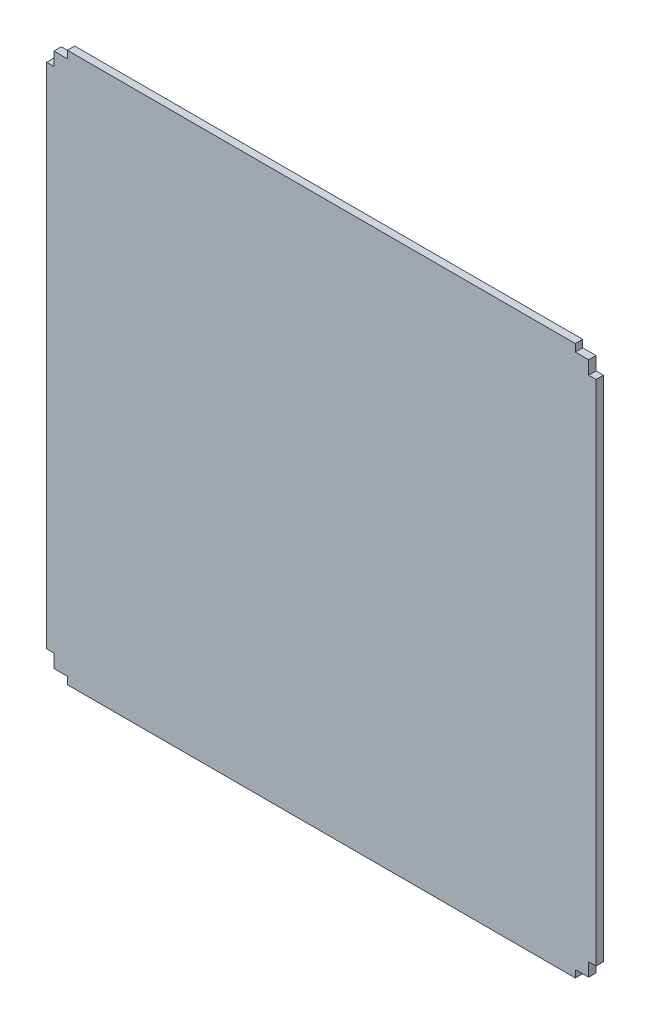
ISO-10303-21;
HEADER;
FILE_DESCRIPTION(('STEP AP214'),'2;1');
FILE_NAME('part.step','',(''),(''),'','','');
FILE_SCHEMA(('AUTOMOTIVE_DESIGN { 1 0 10303 214 1 1 1 1 }'));
ENDSEC;
DATA;
#1=APPLICATION_CONTEXT('core data for automotive mechanical design processes');
#2=APPLICATION_PROTOCOL_DEFINITION('international standard','automotive_design',2000,#1);
#3=PRODUCT_CONTEXT('',#1,'mechanical');
#4=PRODUCT('Part','Part','',(#3));
#5=PRODUCT_RELATED_PRODUCT_CATEGORY('part','',(#4));
#6=PRODUCT_DEFINITION_FORMATION('','',#4);
#7=PRODUCT_DEFINITION_CONTEXT('part definition',#1,'design');
#8=PRODUCT_DEFINITION('design','',#6,#7);
#9=PRODUCT_DEFINITION_SHAPE('','',#8);
#10=(LENGTH_UNIT() NAMED_UNIT(*) SI_UNIT(.MILLI.,.METRE.));
#11=(NAMED_UNIT(*) PLANE_ANGLE_UNIT() SI_UNIT($,.RADIAN.));
#12=(NAMED_UNIT(*) SI_UNIT($,.STERADIAN.) SOLID_ANGLE_UNIT());
#13=UNCERTAINTY_MEASURE_WITH_UNIT(LENGTH_MEASURE(1.E-05),#10,'distance_accuracy_value','');
#14=(GEOMETRIC_REPRESENTATION_CONTEXT(3) GLOBAL_UNCERTAINTY_ASSIGNED_CONTEXT((#13)) GLOBAL_UNIT_ASSIGNED_CONTEXT((#10,
#11,#12)) REPRESENTATION_CONTEXT('',''));
#15=CARTESIAN_POINT('',(0.,0.,0.));
#16=DIRECTION('',(0.,0.,1.));
#17=DIRECTION('',(1.,0.,0.));
#18=AXIS2_PLACEMENT_3D('',#15,#16,#17);
#19=CARTESIAN_POINT('',(0.,0.,2.75));
#20=DIRECTION('',(1.,0.,0.));
#21=DIRECTION('',(0.,0.,-1.));
#22=AXIS2_PLACEMENT_3D('',#19,#20,#21);
#23=PLANE('',#22);
#24=DIRECTION('',(0.,-1.,0.));
#25=VECTOR('',#24,1.);
#26=CARTESIAN_POINT('',(0.,0.,0.));
#27=LINE('',#26,#25);
#28=CARTESIAN_POINT('',(0.,5.,0.));
#29=VERTEX_POINT('',#28);
#30=CARTESIAN_POINT('',(0.,0.,0.));
#31=VERTEX_POINT('',#30);
#32=EDGE_CURVE('E212',#29,#31,#27,.T.);
#33=ORIENTED_EDGE('',*,*,#32,.T.);
#34=DIRECTION('',(0.,0.,-1.));
#35=VECTOR('',#34,1.);
#36=CARTESIAN_POINT('',(0.,0.,2.75));
#37=LINE('',#36,#35);
#38=CARTESIAN_POINT('',(0.,0.,2.75));
#39=VERTEX_POINT('',#38);
#40=EDGE_CURVE('E11',#39,#31,#37,.T.);
#41=ORIENTED_EDGE('',*,*,#40,.F.);
#42=DIRECTION('',(0.,-1.,0.));
#43=VECTOR('',#42,1.);
#44=CARTESIAN_POINT('',(0.,0.,2.75));
#45=LINE('',#44,#43);
#46=CARTESIAN_POINT('',(0.,5.,2.75));
#47=VERTEX_POINT('',#46);
#48=EDGE_CURVE('E270',#47,#39,#45,.T.);
#49=ORIENTED_EDGE('',*,*,#48,.F.);
#50=DIRECTION('',(0.,0.,-1.));
#51=VECTOR('',#50,1.);
#52=CARTESIAN_POINT('',(0.,5.,2.75));
#53=LINE('',#52,#51);
#54=EDGE_CURVE('E208',#47,#29,#53,.T.);
#55=ORIENTED_EDGE('',*,*,#54,.T.);
#56=EDGE_LOOP('',(#33,#41,#49,#55));
#57=FACE_BOUND('',#56,.T.);
#58=ADVANCED_FACE('F39',(#57),#23,.F.);
#59=CARTESIAN_POINT('',(0.,0.,2.75));
#60=DIRECTION('',(0.,1.,0.));
#61=DIRECTION('',(0.,0.,1.));
#62=AXIS2_PLACEMENT_3D('',#59,#60,#61);
#63=PLANE('',#62);
#64=DIRECTION('',(1.,0.,0.));
#65=VECTOR('',#64,1.);
#66=CARTESIAN_POINT('',(0.,0.,0.));
#67=LINE('',#66,#65);
#68=CARTESIAN_POINT('',(5.,0.,0.));
#69=VERTEX_POINT('',#68);
#70=EDGE_CURVE('E216',#31,#69,#67,.T.);
#71=ORIENTED_EDGE('',*,*,#70,.T.);
#72=DIRECTION('',(0.,0.,-1.));
#73=VECTOR('',#72,1.);
#74=CARTESIAN_POINT('',(5.,0.,2.75));
#75=LINE('',#74,#73);
#76=CARTESIAN_POINT('',(5.,0.,2.75));
#77=VERTEX_POINT('',#76);
#78=EDGE_CURVE('E48',#77,#69,#75,.T.);
#79=ORIENTED_EDGE('',*,*,#78,.F.);
#80=DIRECTION('',(1.,0.,0.));
#81=VECTOR('',#80,1.);
#82=CARTESIAN_POINT('',(0.,0.,2.75));
#83=LINE('',#82,#81);
#84=EDGE_CURVE('E135',#39,#77,#83,.T.);
#85=ORIENTED_EDGE('',*,*,#84,.F.);
#86=ORIENTED_EDGE('',*,*,#40,.T.);
#87=EDGE_LOOP('',(#71,#79,#85,#86));
#88=FACE_BOUND('',#87,.T.);
#89=ADVANCED_FACE('F420',(#88),#63,.F.);
#90=CARTESIAN_POINT('',(5.,0.,2.75));
#91=DIRECTION('',(1.,0.,0.));
#92=DIRECTION('',(0.,0.,-1.));
#93=AXIS2_PLACEMENT_3D('',#90,#91,#92);
#94=PLANE('',#93);
#95=DIRECTION('',(0.,-1.,0.));
#96=VECTOR('',#95,1.);
#97=CARTESIAN_POINT('',(5.,0.,0.));
#98=LINE('',#97,#96);
#99=CARTESIAN_POINT('',(5.,-2.75,0.));
#100=VERTEX_POINT('',#99);
#101=EDGE_CURVE('E219',#69,#100,#98,.T.);
#102=ORIENTED_EDGE('',*,*,#101,.T.);
#103=DIRECTION('',(0.,0.,-1.));
#104=VECTOR('',#103,1.);
#105=CARTESIAN_POINT('',(5.,-2.75,2.75));
#106=LINE('',#105,#104);
#107=CARTESIAN_POINT('',(5.,-2.75,2.75));
#108=VERTEX_POINT('',#107);
#109=EDGE_CURVE('E329',#108,#100,#106,.T.);
#110=ORIENTED_EDGE('',*,*,#109,.F.);
#111=DIRECTION('',(0.,-1.,0.));
#112=VECTOR('',#111,1.);
#113=CARTESIAN_POINT('',(5.,0.,2.75));
#114=LINE('',#113,#112);
#115=EDGE_CURVE('E339',#77,#108,#114,.T.);
#116=ORIENTED_EDGE('',*,*,#115,.F.);
#117=ORIENTED_EDGE('',*,*,#78,.T.);
#118=EDGE_LOOP('',(#102,#110,#116,#117));
#119=FACE_BOUND('',#118,.T.);
#120=ADVANCED_FACE('F337',(#119),#94,.F.);
#121=CARTESIAN_POINT('',(195.,-2.75,2.75));
#122=DIRECTION('',(0.,1.,0.));
#123=DIRECTION('',(0.,0.,1.));
#124=AXIS2_PLACEMENT_3D('',#121,#122,#123);
#125=PLANE('',#124);
#126=DIRECTION('',(1.,0.,0.));
#127=VECTOR('',#126,1.);
#128=CARTESIAN_POINT('',(195.,-2.75,0.));
#129=LINE('',#128,#127);
#130=CARTESIAN_POINT('',(195.,-2.75,0.));
#131=VERTEX_POINT('',#130);
#132=EDGE_CURVE('E222',#100,#131,#129,.T.);
#133=ORIENTED_EDGE('',*,*,#132,.T.);
#134=DIRECTION('',(0.,0.,-1.));
#135=VECTOR('',#134,1.);
#136=CARTESIAN_POINT('',(195.,-2.75,2.75));
#137=LINE('',#136,#135);
#138=CARTESIAN_POINT('',(195.,-2.75,2.75));
#139=VERTEX_POINT('',#138);
#140=EDGE_CURVE('E325',#139,#131,#137,.T.);
#141=ORIENTED_EDGE('',*,*,#140,.F.);
#142=DIRECTION('',(1.,0.,0.));
#143=VECTOR('',#142,1.);
#144=CARTESIAN_POINT('',(195.,-2.75,2.75));
#145=LINE('',#144,#143);
#146=EDGE_CURVE('E358',#108,#139,#145,.T.);
#147=ORIENTED_EDGE('',*,*,#146,.F.);
#148=ORIENTED_EDGE('',*,*,#109,.T.);
#149=EDGE_LOOP('',(#133,#141,#147,#148));
#150=FACE_BOUND('',#149,.T.);
#151=ADVANCED_FACE('F348',(#150),#125,.F.);
#152=CARTESIAN_POINT('',(195.,0.,2.75));
#153=DIRECTION('',(-1.,0.,0.));
#154=DIRECTION('',(0.,0.,1.));
#155=AXIS2_PLACEMENT_3D('',#152,#153,#154);
#156=PLANE('',#155);
#157=DIRECTION('',(0.,1.,0.));
#158=VECTOR('',#157,1.);
#159=CARTESIAN_POINT('',(195.,0.,0.));
#160=LINE('',#159,#158);
#161=CARTESIAN_POINT('',(195.,0.,0.));
#162=VERTEX_POINT('',#161);
#163=EDGE_CURVE('E225',#131,#162,#160,.T.);
#164=ORIENTED_EDGE('',*,*,#163,.T.);
#165=DIRECTION('',(0.,0.,-1.));
#166=VECTOR('',#165,1.);
#167=CARTESIAN_POINT('',(195.,0.,2.75));
#168=LINE('',#167,#166);
#169=CARTESIAN_POINT('',(195.,0.,2.75));
#170=VERTEX_POINT('',#169);
#171=EDGE_CURVE('E321',#170,#162,#168,.T.);
#172=ORIENTED_EDGE('',*,*,#171,.F.);
#173=DIRECTION('',(0.,1.,0.));
#174=VECTOR('',#173,1.);
#175=CARTESIAN_POINT('',(195.,0.,2.75));
#176=LINE('',#175,#174);
#177=EDGE_CURVE('E354',#139,#170,#176,.T.);
#178=ORIENTED_EDGE('',*,*,#177,.F.);
#179=ORIENTED_EDGE('',*,*,#140,.T.);
#180=EDGE_LOOP('',(#164,#172,#178,#179));
#181=FACE_BOUND('',#180,.T.);
#182=ADVANCED_FACE('F352',(#181),#156,.F.);
#183=CARTESIAN_POINT('',(200.,0.,2.75));
#184=DIRECTION('',(0.,1.,0.));
#185=DIRECTION('',(0.,0.,1.));
#186=AXIS2_PLACEMENT_3D('',#183,#184,#185);
#187=PLANE('',#186);
#188=DIRECTION('',(1.,0.,0.));
#189=VECTOR('',#188,1.);
#190=CARTESIAN_POINT('',(200.,0.,0.));
#191=LINE('',#190,#189);
#192=CARTESIAN_POINT('',(200.,0.,0.));
#193=VERTEX_POINT('',#192);
#194=EDGE_CURVE('E228',#162,#193,#191,.T.);
#195=ORIENTED_EDGE('',*,*,#194,.T.);
#196=DIRECTION('',(0.,0.,-1.));
#197=VECTOR('',#196,1.);
#198=CARTESIAN_POINT('',(200.,0.,2.75));
#199=LINE('',#198,#197);
#200=CARTESIAN_POINT('',(200.,0.,2.75));
#201=VERTEX_POINT('',#200);
#202=EDGE_CURVE('E317',#201,#193,#199,.T.);
#203=ORIENTED_EDGE('',*,*,#202,.F.);
#204=DIRECTION('',(1.,0.,0.));
#205=VECTOR('',#204,1.);
#206=CARTESIAN_POINT('',(200.,0.,2.75));
#207=LINE('',#206,#205);
#208=EDGE_CURVE('E357',#170,#201,#207,.T.);
#209=ORIENTED_EDGE('',*,*,#208,.F.);
#210=ORIENTED_EDGE('',*,*,#171,.T.);
#211=EDGE_LOOP('',(#195,#203,#209,#210));
#212=FACE_BOUND('',#211,.T.);
#213=ADVANCED_FACE('F433',(#212),#187,.F.);
#214=CARTESIAN_POINT('',(200.,0.,2.75));
#215=DIRECTION('',(-1.,0.,0.));
#216=DIRECTION('',(0.,0.,1.));
#217=AXIS2_PLACEMENT_3D('',#214,#215,#216);
#218=PLANE('',#217);
#219=DIRECTION('',(0.,1.,0.));
#220=VECTOR('',#219,1.);
#221=CARTESIAN_POINT('',(200.,0.,0.));
#222=LINE('',#221,#220);
#223=CARTESIAN_POINT('',(200.,5.,0.));
#224=VERTEX_POINT('',#223);
#225=EDGE_CURVE('E231',#193,#224,#222,.T.);
#226=ORIENTED_EDGE('',*,*,#225,.T.);
#227=DIRECTION('',(0.,0.,-1.));
#228=VECTOR('',#227,1.);
#229=CARTESIAN_POINT('',(200.,5.,2.75));
#230=LINE('',#229,#228);
#231=CARTESIAN_POINT('',(200.,5.,2.75));
#232=VERTEX_POINT('',#231);
#233=EDGE_CURVE('E313',#232,#224,#230,.T.);
#234=ORIENTED_EDGE('',*,*,#233,.F.);
#235=DIRECTION('',(0.,1.,0.));
#236=VECTOR('',#235,1.);
#237=CARTESIAN_POINT('',(200.,0.,2.75));
#238=LINE('',#237,#236);
#239=EDGE_CURVE('E362',#201,#232,#238,.T.);
#240=ORIENTED_EDGE('',*,*,#239,.F.);
#241=ORIENTED_EDGE('',*,*,#202,.T.);
#242=EDGE_LOOP('',(#226,#234,#240,#241));
#243=FACE_BOUND('',#242,.T.);
#244=ADVANCED_FACE('F436',(#243),#218,.F.);
#245=CARTESIAN_POINT('',(200.,5.,2.75));
#246=DIRECTION('',(0.,1.,0.));
#247=DIRECTION('',(0.,0.,1.));
#248=AXIS2_PLACEMENT_3D('',#245,#246,#247);
#249=PLANE('',#248);
#250=DIRECTION('',(1.,0.,0.));
#251=VECTOR('',#250,1.);
#252=CARTESIAN_POINT('',(200.,5.,0.));
#253=LINE('',#252,#251);
#254=CARTESIAN_POINT('',(202.75,5.,0.));
#255=VERTEX_POINT('',#254);
#256=EDGE_CURVE('E234',#224,#255,#253,.T.);
#257=ORIENTED_EDGE('',*,*,#256,.T.);
#258=DIRECTION('',(0.,0.,-1.));
#259=VECTOR('',#258,1.);
#260=CARTESIAN_POINT('',(202.75,5.,2.75));
#261=LINE('',#260,#259);
#262=CARTESIAN_POINT('',(202.75,5.,2.75));
#263=VERTEX_POINT('',#262);
#264=EDGE_CURVE('E309',#263,#255,#261,.T.);
#265=ORIENTED_EDGE('',*,*,#264,.F.);
#266=DIRECTION('',(1.,0.,0.));
#267=VECTOR('',#266,1.);
#268=CARTESIAN_POINT('',(200.,5.,2.75));
#269=LINE('',#268,#267);
#270=EDGE_CURVE('E369',#232,#263,#269,.T.);
#271=ORIENTED_EDGE('',*,*,#270,.F.);
#272=ORIENTED_EDGE('',*,*,#233,.T.);
#273=EDGE_LOOP('',(#257,#265,#271,#272));
#274=FACE_BOUND('',#273,.T.);
#275=ADVANCED_FACE('F440',(#274),#249,.F.);
#276=CARTESIAN_POINT('',(202.75,5.,2.75));
#277=DIRECTION('',(-1.,0.,0.));
#278=DIRECTION('',(0.,0.,1.));
#279=AXIS2_PLACEMENT_3D('',#276,#277,#278);
#280=PLANE('',#279);
#281=DIRECTION('',(0.,1.,0.));
#282=VECTOR('',#281,1.);
#283=CARTESIAN_POINT('',(202.75,5.,0.));
#284=LINE('',#283,#282);
#285=CARTESIAN_POINT('',(202.75,195.,0.));
#286=VERTEX_POINT('',#285);
#287=EDGE_CURVE('E237',#255,#286,#284,.T.);
#288=ORIENTED_EDGE('',*,*,#287,.T.);
#289=DIRECTION('',(0.,0.,-1.));
#290=VECTOR('',#289,1.);
#291=CARTESIAN_POINT('',(202.75,195.,2.75));
#292=LINE('',#291,#290);
#293=CARTESIAN_POINT('',(202.75,195.,2.75));
#294=VERTEX_POINT('',#293);
#295=EDGE_CURVE('E305',#294,#286,#292,.T.);
#296=ORIENTED_EDGE('',*,*,#295,.F.);
#297=DIRECTION('',(0.,1.,0.));
#298=VECTOR('',#297,1.);
#299=CARTESIAN_POINT('',(202.75,5.,2.75));
#300=LINE('',#299,#298);
#301=EDGE_CURVE('E372',#263,#294,#300,.T.);
#302=ORIENTED_EDGE('',*,*,#301,.F.);
#303=ORIENTED_EDGE('',*,*,#264,.T.);
#304=EDGE_LOOP('',(#288,#296,#302,#303));
#305=FACE_BOUND('',#304,.T.);
#306=ADVANCED_FACE('F444',(#305),#280,.F.);
#307=CARTESIAN_POINT('',(202.75,195.,2.75));
#308=DIRECTION('',(0.,-1.,0.));
#309=DIRECTION('',(0.,0.,-1.));
#310=AXIS2_PLACEMENT_3D('',#307,#308,#309);
#311=PLANE('',#310);
#312=DIRECTION('',(-1.,0.,0.));
#313=VECTOR('',#312,1.);
#314=CARTESIAN_POINT('',(202.75,195.,0.));
#315=LINE('',#314,#313);
#316=CARTESIAN_POINT('',(200.,195.,0.));
#317=VERTEX_POINT('',#316);
#318=EDGE_CURVE('E240',#286,#317,#315,.T.);
#319=ORIENTED_EDGE('',*,*,#318,.T.);
#320=DIRECTION('',(0.,0.,-1.));
#321=VECTOR('',#320,1.);
#322=CARTESIAN_POINT('',(200.,195.,2.75));
#323=LINE('',#322,#321);
#324=CARTESIAN_POINT('',(200.,195.,2.75));
#325=VERTEX_POINT('',#324);
#326=EDGE_CURVE('E301',#325,#317,#323,.T.);
#327=ORIENTED_EDGE('',*,*,#326,.F.);
#328=DIRECTION('',(-1.,0.,0.));
#329=VECTOR('',#328,1.);
#330=CARTESIAN_POINT('',(202.75,195.,2.75));
#331=LINE('',#330,#329);
#332=EDGE_CURVE('E375',#294,#325,#331,.T.);
#333=ORIENTED_EDGE('',*,*,#332,.F.);
#334=ORIENTED_EDGE('',*,*,#295,.T.);
#335=EDGE_LOOP('',(#319,#327,#333,#334));
#336=FACE_BOUND('',#335,.T.);
#337=ADVANCED_FACE('F448',(#336),#311,.F.);
#338=CARTESIAN_POINT('',(200.,195.,2.75));
#339=DIRECTION('',(-1.,0.,0.));
#340=DIRECTION('',(0.,0.,1.));
#341=AXIS2_PLACEMENT_3D('',#338,#339,#340);
#342=PLANE('',#341);
#343=DIRECTION('',(0.,1.,0.));
#344=VECTOR('',#343,1.);
#345=CARTESIAN_POINT('',(200.,195.,0.));
#346=LINE('',#345,#344);
#347=CARTESIAN_POINT('',(200.,200.,0.));
#348=VERTEX_POINT('',#347);
#349=EDGE_CURVE('E243',#317,#348,#346,.T.);
#350=ORIENTED_EDGE('',*,*,#349,.T.);
#351=DIRECTION('',(0.,0.,-1.));
#352=VECTOR('',#351,1.);
#353=CARTESIAN_POINT('',(200.,200.,2.75));
#354=LINE('',#353,#352);
#355=CARTESIAN_POINT('',(200.,200.,2.75));
#356=VERTEX_POINT('',#355);
#357=EDGE_CURVE('E297',#356,#348,#354,.T.);
#358=ORIENTED_EDGE('',*,*,#357,.F.);
#359=DIRECTION('',(0.,1.,0.));
#360=VECTOR('',#359,1.);
#361=CARTESIAN_POINT('',(200.,195.,2.75));
#362=LINE('',#361,#360);
#363=EDGE_CURVE('E378',#325,#356,#362,.T.);
#364=ORIENTED_EDGE('',*,*,#363,.F.);
#365=ORIENTED_EDGE('',*,*,#326,.T.);
#366=EDGE_LOOP('',(#350,#358,#364,#365));
#367=FACE_BOUND('',#366,.T.);
#368=ADVANCED_FACE('F452',(#367),#342,.F.);
#369=CARTESIAN_POINT('',(200.,200.,2.75));
#370=DIRECTION('',(0.,-1.,0.));
#371=DIRECTION('',(0.,0.,-1.));
#372=AXIS2_PLACEMENT_3D('',#369,#370,#371);
#373=PLANE('',#372);
#374=DIRECTION('',(-1.,0.,0.));
#375=VECTOR('',#374,1.);
#376=CARTESIAN_POINT('',(200.,200.,0.));
#377=LINE('',#376,#375);
#378=CARTESIAN_POINT('',(195.,200.,0.));
#379=VERTEX_POINT('',#378);
#380=EDGE_CURVE('E246',#348,#379,#377,.T.);
#381=ORIENTED_EDGE('',*,*,#380,.T.);
#382=DIRECTION('',(0.,0.,-1.));
#383=VECTOR('',#382,1.);
#384=CARTESIAN_POINT('',(195.,200.,2.75));
#385=LINE('',#384,#383);
#386=CARTESIAN_POINT('',(195.,200.,2.75));
#387=VERTEX_POINT('',#386);
#388=EDGE_CURVE('E293',#387,#379,#385,.T.);
#389=ORIENTED_EDGE('',*,*,#388,.F.);
#390=DIRECTION('',(-1.,0.,0.));
#391=VECTOR('',#390,1.);
#392=CARTESIAN_POINT('',(200.,200.,2.75));
#393=LINE('',#392,#391);
#394=EDGE_CURVE('E381',#356,#387,#393,.T.);
#395=ORIENTED_EDGE('',*,*,#394,.F.);
#396=ORIENTED_EDGE('',*,*,#357,.T.);
#397=EDGE_LOOP('',(#381,#389,#395,#396));
#398=FACE_BOUND('',#397,.T.);
#399=ADVANCED_FACE('F456',(#398),#373,.F.);
#400=CARTESIAN_POINT('',(195.,200.,2.75));
#401=DIRECTION('',(-1.,0.,0.));
#402=DIRECTION('',(0.,0.,1.));
#403=AXIS2_PLACEMENT_3D('',#400,#401,#402);
#404=PLANE('',#403);
#405=DIRECTION('',(0.,1.,0.));
#406=VECTOR('',#405,1.);
#407=CARTESIAN_POINT('',(195.,200.,0.));
#408=LINE('',#407,#406);
#409=CARTESIAN_POINT('',(195.,202.75,0.));
#410=VERTEX_POINT('',#409);
#411=EDGE_CURVE('E249',#379,#410,#408,.T.);
#412=ORIENTED_EDGE('',*,*,#411,.T.);
#413=DIRECTION('',(0.,0.,-1.));
#414=VECTOR('',#413,1.);
#415=CARTESIAN_POINT('',(195.,202.75,2.75));
#416=LINE('',#415,#414);
#417=CARTESIAN_POINT('',(195.,202.75,2.75));
#418=VERTEX_POINT('',#417);
#419=EDGE_CURVE('E289',#418,#410,#416,.T.);
#420=ORIENTED_EDGE('',*,*,#419,.F.);
#421=DIRECTION('',(0.,1.,0.));
#422=VECTOR('',#421,1.);
#423=CARTESIAN_POINT('',(195.,200.,2.75));
#424=LINE('',#423,#422);
#425=EDGE_CURVE('E384',#387,#418,#424,.T.);
#426=ORIENTED_EDGE('',*,*,#425,.F.);
#427=ORIENTED_EDGE('',*,*,#388,.T.);
#428=EDGE_LOOP('',(#412,#420,#426,#427));
#429=FACE_BOUND('',#428,.T.);
#430=ADVANCED_FACE('F460',(#429),#404,.F.);
#431=CARTESIAN_POINT('',(195.,202.75,2.75));
#432=DIRECTION('',(0.,-1.,0.));
#433=DIRECTION('',(0.,0.,-1.));
#434=AXIS2_PLACEMENT_3D('',#431,#432,#433);
#435=PLANE('',#434);
#436=DIRECTION('',(-1.,0.,0.));
#437=VECTOR('',#436,1.);
#438=CARTESIAN_POINT('',(195.,202.75,0.));
#439=LINE('',#438,#437);
#440=CARTESIAN_POINT('',(5.,202.75,0.));
#441=VERTEX_POINT('',#440);
#442=EDGE_CURVE('E252',#410,#441,#439,.T.);
#443=ORIENTED_EDGE('',*,*,#442,.T.);
#444=DIRECTION('',(0.,0.,-1.));
#445=VECTOR('',#444,1.);
#446=CARTESIAN_POINT('',(5.,202.75,2.75));
#447=LINE('',#446,#445);
#448=CARTESIAN_POINT('',(5.,202.75,2.75));
#449=VERTEX_POINT('',#448);
#450=EDGE_CURVE('E285',#449,#441,#447,.T.);
#451=ORIENTED_EDGE('',*,*,#450,.F.);
#452=DIRECTION('',(-1.,0.,0.));
#453=VECTOR('',#452,1.);
#454=CARTESIAN_POINT('',(195.,202.75,2.75));
#455=LINE('',#454,#453);
#456=EDGE_CURVE('E387',#418,#449,#455,.T.);
#457=ORIENTED_EDGE('',*,*,#456,.F.);
#458=ORIENTED_EDGE('',*,*,#419,.T.);
#459=EDGE_LOOP('',(#443,#451,#457,#458));
#460=FACE_BOUND('',#459,.T.);
#461=ADVANCED_FACE('F464',(#460),#435,.F.);
#462=CARTESIAN_POINT('',(5.,202.75,2.75));
#463=DIRECTION('',(1.,0.,0.));
#464=DIRECTION('',(0.,0.,-1.));
#465=AXIS2_PLACEMENT_3D('',#462,#463,#464);
#466=PLANE('',#465);
#467=DIRECTION('',(0.,-1.,0.));
#468=VECTOR('',#467,1.);
#469=CARTESIAN_POINT('',(5.,202.75,0.));
#470=LINE('',#469,#468);
#471=CARTESIAN_POINT('',(5.,200.,0.));
#472=VERTEX_POINT('',#471);
#473=EDGE_CURVE('E255',#441,#472,#470,.T.);
#474=ORIENTED_EDGE('',*,*,#473,.T.);
#475=DIRECTION('',(0.,0.,-1.));
#476=VECTOR('',#475,1.);
#477=CARTESIAN_POINT('',(5.,200.,2.75));
#478=LINE('',#477,#476);
#479=CARTESIAN_POINT('',(5.,200.,2.75));
#480=VERTEX_POINT('',#479);
#481=EDGE_CURVE('E281',#480,#472,#478,.T.);
#482=ORIENTED_EDGE('',*,*,#481,.F.);
#483=DIRECTION('',(0.,-1.,0.));
#484=VECTOR('',#483,1.);
#485=CARTESIAN_POINT('',(5.,202.75,2.75));
#486=LINE('',#485,#484);
#487=EDGE_CURVE('E390',#449,#480,#486,.T.);
#488=ORIENTED_EDGE('',*,*,#487,.F.);
#489=ORIENTED_EDGE('',*,*,#450,.T.);
#490=EDGE_LOOP('',(#474,#482,#488,#489));
#491=FACE_BOUND('',#490,.T.);
#492=ADVANCED_FACE('F468',(#491),#466,.F.);
#493=CARTESIAN_POINT('',(0.,200.,2.75));
#494=DIRECTION('',(0.,-1.,0.));
#495=DIRECTION('',(0.,0.,-1.));
#496=AXIS2_PLACEMENT_3D('',#493,#494,#495);
#497=PLANE('',#496);
#498=DIRECTION('',(-1.,0.,0.));
#499=VECTOR('',#498,1.);
#500=CARTESIAN_POINT('',(0.,200.,0.));
#501=LINE('',#500,#499);
#502=CARTESIAN_POINT('',(0.,200.,0.));
#503=VERTEX_POINT('',#502);
#504=EDGE_CURVE('E258',#472,#503,#501,.T.);
#505=ORIENTED_EDGE('',*,*,#504,.T.);
#506=DIRECTION('',(0.,0.,-1.));
#507=VECTOR('',#506,1.);
#508=CARTESIAN_POINT('',(0.,200.,2.75));
#509=LINE('',#508,#507);
#510=CARTESIAN_POINT('',(0.,200.,2.75));
#511=VERTEX_POINT('',#510);
#512=EDGE_CURVE('E277',#511,#503,#509,.T.);
#513=ORIENTED_EDGE('',*,*,#512,.F.);
#514=DIRECTION('',(-1.,0.,0.));
#515=VECTOR('',#514,1.);
#516=CARTESIAN_POINT('',(0.,200.,2.75));
#517=LINE('',#516,#515);
#518=EDGE_CURVE('E393',#480,#511,#517,.T.);
#519=ORIENTED_EDGE('',*,*,#518,.F.);
#520=ORIENTED_EDGE('',*,*,#481,.T.);
#521=EDGE_LOOP('',(#505,#513,#519,#520));
#522=FACE_BOUND('',#521,.T.);
#523=ADVANCED_FACE('F401',(#522),#497,.F.);
#524=CARTESIAN_POINT('',(0.,200.,2.75));
#525=DIRECTION('',(1.,0.,0.));
#526=DIRECTION('',(0.,0.,-1.));
#527=AXIS2_PLACEMENT_3D('',#524,#525,#526);
#528=PLANE('',#527);
#529=DIRECTION('',(0.,-1.,0.));
#530=VECTOR('',#529,1.);
#531=CARTESIAN_POINT('',(0.,200.,0.));
#532=LINE('',#531,#530);
#533=CARTESIAN_POINT('',(0.,195.,0.));
#534=VERTEX_POINT('',#533);
#535=EDGE_CURVE('E261',#503,#534,#532,.T.);
#536=ORIENTED_EDGE('',*,*,#535,.T.);
#537=DIRECTION('',(0.,0.,-1.));
#538=VECTOR('',#537,1.);
#539=CARTESIAN_POINT('',(0.,195.,2.75));
#540=LINE('',#539,#538);
#541=CARTESIAN_POINT('',(0.,195.,2.75));
#542=VERTEX_POINT('',#541);
#543=EDGE_CURVE('E201',#542,#534,#540,.T.);
#544=ORIENTED_EDGE('',*,*,#543,.F.);
#545=DIRECTION('',(0.,-1.,0.));
#546=VECTOR('',#545,1.);
#547=CARTESIAN_POINT('',(0.,200.,2.75));
#548=LINE('',#547,#546);
#549=EDGE_CURVE('E190',#511,#542,#548,.T.);
#550=ORIENTED_EDGE('',*,*,#549,.F.);
#551=ORIENTED_EDGE('',*,*,#512,.T.);
#552=EDGE_LOOP('',(#536,#544,#550,#551));
#553=FACE_BOUND('',#552,.T.);
#554=ADVANCED_FACE('F405',(#553),#528,.F.);
#555=CARTESIAN_POINT('',(0.,195.,2.75));
#556=DIRECTION('',(0.,-1.,0.));
#557=DIRECTION('',(0.,0.,-1.));
#558=AXIS2_PLACEMENT_3D('',#555,#556,#557);
#559=PLANE('',#558);
#560=DIRECTION('',(-1.,0.,0.));
#561=VECTOR('',#560,1.);
#562=CARTESIAN_POINT('',(0.,195.,0.));
#563=LINE('',#562,#561);
#564=CARTESIAN_POINT('',(-2.75,195.,0.));
#565=VERTEX_POINT('',#564);
#566=EDGE_CURVE('E199',#534,#565,#563,.T.);
#567=ORIENTED_EDGE('',*,*,#566,.T.);
#568=DIRECTION('',(0.,0.,-1.));
#569=VECTOR('',#568,1.);
#570=CARTESIAN_POINT('',(-2.75,195.,2.75));
#571=LINE('',#570,#569);
#572=CARTESIAN_POINT('',(-2.75,195.,2.75));
#573=VERTEX_POINT('',#572);
#574=EDGE_CURVE('E196',#573,#565,#571,.T.);
#575=ORIENTED_EDGE('',*,*,#574,.F.);
#576=DIRECTION('',(-1.,0.,0.));
#577=VECTOR('',#576,1.);
#578=CARTESIAN_POINT('',(0.,195.,2.75));
#579=LINE('',#578,#577);
#580=EDGE_CURVE('E184',#542,#573,#579,.T.);
#581=ORIENTED_EDGE('',*,*,#580,.F.);
#582=ORIENTED_EDGE('',*,*,#543,.T.);
#583=EDGE_LOOP('',(#567,#575,#581,#582));
#584=FACE_BOUND('',#583,.T.);
#585=ADVANCED_FACE('F197',(#584),#559,.F.);
#586=CARTESIAN_POINT('',(-2.75,195.,2.75));
#587=DIRECTION('',(1.,0.,0.));
#588=DIRECTION('',(0.,0.,-1.));
#589=AXIS2_PLACEMENT_3D('',#586,#587,#588);
#590=PLANE('',#589);
#591=DIRECTION('',(0.,-1.,0.));
#592=VECTOR('',#591,1.);
#593=CARTESIAN_POINT('',(-2.75,195.,0.));
#594=LINE('',#593,#592);
#595=CARTESIAN_POINT('',(-2.75,5.,0.));
#596=VERTEX_POINT('',#595);
#597=EDGE_CURVE('E121',#565,#596,#594,.T.);
#598=ORIENTED_EDGE('',*,*,#597,.T.);
#599=DIRECTION('',(0.,0.,-1.));
#600=VECTOR('',#599,1.);
#601=CARTESIAN_POINT('',(-2.75,5.,2.75));
#602=LINE('',#601,#600);
#603=CARTESIAN_POINT('',(-2.75,5.,2.75));
#604=VERTEX_POINT('',#603);
#605=EDGE_CURVE('E202',#604,#596,#602,.T.);
#606=ORIENTED_EDGE('',*,*,#605,.F.);
#607=DIRECTION('',(0.,-1.,0.));
#608=VECTOR('',#607,1.);
#609=CARTESIAN_POINT('',(-2.75,195.,2.75));
#610=LINE('',#609,#608);
#611=EDGE_CURVE('E188',#573,#604,#610,.T.);
#612=ORIENTED_EDGE('',*,*,#611,.F.);
#613=ORIENTED_EDGE('',*,*,#574,.T.);
#614=EDGE_LOOP('',(#598,#606,#612,#613));
#615=FACE_BOUND('',#614,.T.);
#616=ADVANCED_FACE('F204',(#615),#590,.F.);
#617=CARTESIAN_POINT('',(-2.75,5.,2.75));
#618=DIRECTION('',(0.,1.,0.));
#619=DIRECTION('',(0.,0.,1.));
#620=AXIS2_PLACEMENT_3D('',#617,#618,#619);
#621=PLANE('',#620);
#622=DIRECTION('',(1.,0.,0.));
#623=VECTOR('',#622,1.);
#624=CARTESIAN_POINT('',(-2.75,5.,0.));
#625=LINE('',#624,#623);
#626=EDGE_CURVE('E127',#596,#29,#625,.T.);
#627=ORIENTED_EDGE('',*,*,#626,.T.);
#628=ORIENTED_EDGE('',*,*,#54,.F.);
#629=DIRECTION('',(1.,0.,0.));
#630=VECTOR('',#629,1.);
#631=CARTESIAN_POINT('',(-2.75,5.,2.75));
#632=LINE('',#631,#630);
#633=EDGE_CURVE('E56',#604,#47,#632,.T.);
#634=ORIENTED_EDGE('',*,*,#633,.F.);
#635=ORIENTED_EDGE('',*,*,#605,.T.);
#636=EDGE_LOOP('',(#627,#628,#634,#635));
#637=FACE_BOUND('',#636,.T.);
#638=ADVANCED_FACE('F409',(#637),#621,.F.);
#639=CARTESIAN_POINT('',(0.,0.,2.75));
#640=DIRECTION('',(0.,0.,-1.));
#641=DIRECTION('',(-1.,0.,0.));
#642=AXIS2_PLACEMENT_3D('',#639,#640,#641);
#643=PLANE('',#642);
#644=ORIENTED_EDGE('',*,*,#48,.T.);
#645=ORIENTED_EDGE('',*,*,#84,.T.);
#646=ORIENTED_EDGE('',*,*,#115,.T.);
#647=ORIENTED_EDGE('',*,*,#146,.T.);
#648=ORIENTED_EDGE('',*,*,#177,.T.);
#649=ORIENTED_EDGE('',*,*,#208,.T.);
#650=ORIENTED_EDGE('',*,*,#239,.T.);
#651=ORIENTED_EDGE('',*,*,#270,.T.);
#652=ORIENTED_EDGE('',*,*,#301,.T.);
#653=ORIENTED_EDGE('',*,*,#332,.T.);
#654=ORIENTED_EDGE('',*,*,#363,.T.);
#655=ORIENTED_EDGE('',*,*,#394,.T.);
#656=ORIENTED_EDGE('',*,*,#425,.T.);
#657=ORIENTED_EDGE('',*,*,#456,.T.);
#658=ORIENTED_EDGE('',*,*,#487,.T.);
#659=ORIENTED_EDGE('',*,*,#518,.T.);
#660=ORIENTED_EDGE('',*,*,#549,.T.);
#661=ORIENTED_EDGE('',*,*,#580,.T.);
#662=ORIENTED_EDGE('',*,*,#611,.T.);
#663=ORIENTED_EDGE('',*,*,#633,.T.);
#664=EDGE_LOOP('',(#644,#645,#646,#647,#648,#649,#650,#651,#652,#653,#654,#655,#656,#657,#658,
#659,#660,#661,#662,#663));
#665=FACE_BOUND('',#664,.T.);
#666=ADVANCED_FACE('F186',(#665),#643,.F.);
#667=CARTESIAN_POINT('',(0.,0.,0.));
#668=DIRECTION('',(0.,0.,-1.));
#669=DIRECTION('',(-1.,0.,0.));
#670=AXIS2_PLACEMENT_3D('',#667,#668,#669);
#671=PLANE('',#670);
#672=ORIENTED_EDGE('',*,*,#32,.F.);
#673=ORIENTED_EDGE('',*,*,#626,.F.);
#674=ORIENTED_EDGE('',*,*,#597,.F.);
#675=ORIENTED_EDGE('',*,*,#566,.F.);
#676=ORIENTED_EDGE('',*,*,#535,.F.);
#677=ORIENTED_EDGE('',*,*,#504,.F.);
#678=ORIENTED_EDGE('',*,*,#473,.F.);
#679=ORIENTED_EDGE('',*,*,#442,.F.);
#680=ORIENTED_EDGE('',*,*,#411,.F.);
#681=ORIENTED_EDGE('',*,*,#380,.F.);
#682=ORIENTED_EDGE('',*,*,#349,.F.);
#683=ORIENTED_EDGE('',*,*,#318,.F.);
#684=ORIENTED_EDGE('',*,*,#287,.F.);
#685=ORIENTED_EDGE('',*,*,#256,.F.);
#686=ORIENTED_EDGE('',*,*,#225,.F.);
#687=ORIENTED_EDGE('',*,*,#194,.F.);
#688=ORIENTED_EDGE('',*,*,#163,.F.);
#689=ORIENTED_EDGE('',*,*,#132,.F.);
#690=ORIENTED_EDGE('',*,*,#101,.F.);
#691=ORIENTED_EDGE('',*,*,#70,.F.);
#692=EDGE_LOOP('',(#672,#673,#674,#675,#676,#677,#678,#679,#680,#681,#682,#683,#684,#685,#686,
#687,#688,#689,#690,#691));
#693=FACE_BOUND('',#692,.T.);
#694=ADVANCED_FACE('F343',(#693),#671,.T.);
#695=CLOSED_SHELL('',(#58,#89,#120,#151,#182,#213,#244,#275,#306,#337,#368,#399,#430,#461,#492,
#523,#554,#585,#616,#638,#666,#694));
#696=MANIFOLD_SOLID_BREP('B2',#695);
#697=ADVANCED_BREP_SHAPE_REPRESENTATION('',(#18,#696),#14);
#698=SHAPE_DEFINITION_REPRESENTATION(#9,#697);
ENDSEC;
END-ISO-10303-21;
